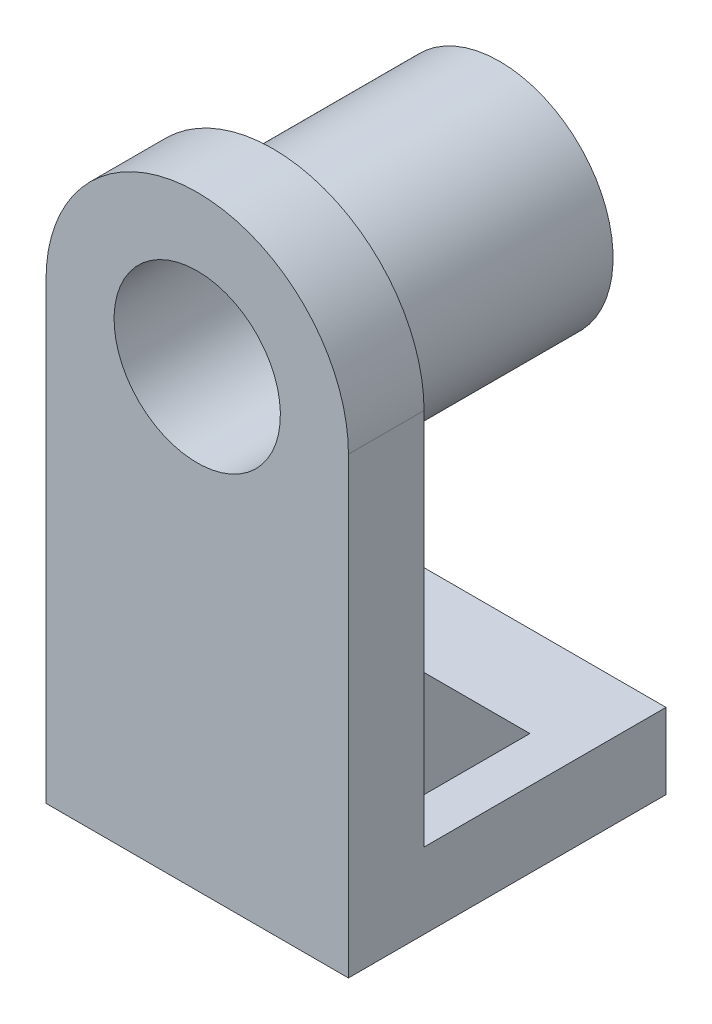
ISO-10303-21;
HEADER;
FILE_DESCRIPTION(('STEP AP214'),'2;1');
FILE_NAME('part.step','',(''),(''),'','','');
FILE_SCHEMA(('AUTOMOTIVE_DESIGN { 1 0 10303 214 1 1 1 1 }'));
ENDSEC;
DATA;
#1=APPLICATION_CONTEXT('core data for automotive mechanical design processes');
#2=APPLICATION_PROTOCOL_DEFINITION('international standard','automotive_design',2000,#1);
#3=PRODUCT_CONTEXT('',#1,'mechanical');
#4=PRODUCT('Part','Part','',(#3));
#5=PRODUCT_RELATED_PRODUCT_CATEGORY('part','',(#4));
#6=PRODUCT_DEFINITION_FORMATION('','',#4);
#7=PRODUCT_DEFINITION_CONTEXT('part definition',#1,'design');
#8=PRODUCT_DEFINITION('design','',#6,#7);
#9=PRODUCT_DEFINITION_SHAPE('','',#8);
#10=(LENGTH_UNIT() NAMED_UNIT(*) SI_UNIT(.MILLI.,.METRE.));
#11=(NAMED_UNIT(*) PLANE_ANGLE_UNIT() SI_UNIT($,.RADIAN.));
#12=(NAMED_UNIT(*) SI_UNIT($,.STERADIAN.) SOLID_ANGLE_UNIT());
#13=UNCERTAINTY_MEASURE_WITH_UNIT(LENGTH_MEASURE(1.E-05),#10,'distance_accuracy_value','');
#14=(GEOMETRIC_REPRESENTATION_CONTEXT(3) GLOBAL_UNCERTAINTY_ASSIGNED_CONTEXT((#13)) GLOBAL_UNIT_ASSIGNED_CONTEXT((#10,
#11,#12)) REPRESENTATION_CONTEXT('',''));
#15=CARTESIAN_POINT('',(0.,0.,0.));
#16=DIRECTION('',(0.,0.,1.));
#17=DIRECTION('',(1.,0.,0.));
#18=AXIS2_PLACEMENT_3D('',#15,#16,#17);
#19=CARTESIAN_POINT('',(20.,50.,10.));
#20=DIRECTION('',(0.,0.,-1.));
#21=DIRECTION('',(-1.,0.,0.));
#22=AXIS2_PLACEMENT_3D('',#19,#20,#21);
#23=CYLINDRICAL_SURFACE('',#22,20.);
#24=DIRECTION('',(0.,0.,-1.));
#25=VECTOR('',#24,1.);
#26=CARTESIAN_POINT('',(0.,50.,0.));
#27=LINE('',#26,#25);
#28=CARTESIAN_POINT('',(0.,50.,10.));
#29=VERTEX_POINT('',#28);
#30=CARTESIAN_POINT('',(0.,50.,0.));
#31=VERTEX_POINT('',#30);
#32=EDGE_CURVE('E161',#29,#31,#27,.T.);
#33=ORIENTED_EDGE('',*,*,#32,.F.);
#34=CARTESIAN_POINT('',(20.,50.,10.));
#35=DIRECTION('',(0.,0.,-1.));
#36=DIRECTION('',(0.,1.,0.));
#37=AXIS2_PLACEMENT_3D('',#34,#35,#36);
#38=CIRCLE('',#37,20.);
#39=CARTESIAN_POINT('',(40.,50.,10.));
#40=VERTEX_POINT('',#39);
#41=EDGE_CURVE('E43',#40,#29,#38,.F.);
#42=ORIENTED_EDGE('',*,*,#41,.F.);
#43=DIRECTION('',(0.,0.,1.));
#44=VECTOR('',#43,1.);
#45=CARTESIAN_POINT('',(40.,50.,10.));
#46=LINE('',#45,#44);
#47=CARTESIAN_POINT('',(40.,50.,0.));
#48=VERTEX_POINT('',#47);
#49=EDGE_CURVE('E164',#48,#40,#46,.T.);
#50=ORIENTED_EDGE('',*,*,#49,.F.);
#51=CARTESIAN_POINT('',(20.,50.,0.));
#52=DIRECTION('',(0.,0.,-1.));
#53=DIRECTION('',(0.,1.,0.));
#54=AXIS2_PLACEMENT_3D('',#51,#52,#53);
#55=CIRCLE('',#54,20.);
#56=EDGE_CURVE('E11',#31,#48,#55,.T.);
#57=ORIENTED_EDGE('',*,*,#56,.F.);
#58=EDGE_LOOP('',(#33,#42,#50,#57));
#59=FACE_BOUND('',#58,.T.);
#60=ADVANCED_FACE('F35',(#59),#23,.T.);
#61=CARTESIAN_POINT('',(40.,-10.,0.));
#62=DIRECTION('',(0.,1.,0.));
#63=DIRECTION('',(0.,0.,1.));
#64=AXIS2_PLACEMENT_3D('',#61,#62,#63);
#65=PLANE('',#64);
#66=DIRECTION('',(0.,0.,-1.));
#67=VECTOR('',#66,1.);
#68=CARTESIAN_POINT('',(0.,-10.,0.));
#69=LINE('',#68,#67);
#70=CARTESIAN_POINT('',(0.,-10.,10.));
#71=VERTEX_POINT('',#70);
#72=CARTESIAN_POINT('',(0.,-10.,-32.));
#73=VERTEX_POINT('',#72);
#74=EDGE_CURVE('E184',#71,#73,#69,.T.);
#75=ORIENTED_EDGE('',*,*,#74,.T.);
#76=DIRECTION('',(-1.,0.,0.));
#77=VECTOR('',#76,1.);
#78=CARTESIAN_POINT('',(40.,-10.,-32.));
#79=LINE('',#78,#77);
#80=CARTESIAN_POINT('',(40.,-10.,-32.));
#81=VERTEX_POINT('',#80);
#82=EDGE_CURVE('E159',#81,#73,#79,.T.);
#83=ORIENTED_EDGE('',*,*,#82,.F.);
#84=DIRECTION('',(0.,0.,-1.));
#85=VECTOR('',#84,1.);
#86=CARTESIAN_POINT('',(40.,-10.,0.));
#87=LINE('',#86,#85);
#88=CARTESIAN_POINT('',(40.,-10.,10.));
#89=VERTEX_POINT('',#88);
#90=EDGE_CURVE('E185',#89,#81,#87,.T.);
#91=ORIENTED_EDGE('',*,*,#90,.F.);
#92=DIRECTION('',(-1.,0.,0.));
#93=VECTOR('',#92,1.);
#94=CARTESIAN_POINT('',(40.,-10.,10.));
#95=LINE('',#94,#93);
#96=EDGE_CURVE('E154',#89,#71,#95,.T.);
#97=ORIENTED_EDGE('',*,*,#96,.T.);
#98=EDGE_LOOP('',(#75,#83,#91,#97));
#99=FACE_BOUND('',#98,.T.);
#100=ADVANCED_FACE('F260',(#99),#65,.F.);
#101=CARTESIAN_POINT('',(40.,0.,-32.));
#102=DIRECTION('',(0.,0.,-1.));
#103=DIRECTION('',(-1.,0.,0.));
#104=AXIS2_PLACEMENT_3D('',#101,#102,#103);
#105=PLANE('',#104);
#106=DIRECTION('',(0.,-1.,0.));
#107=VECTOR('',#106,1.);
#108=CARTESIAN_POINT('',(0.,0.,-32.));
#109=LINE('',#108,#107);
#110=CARTESIAN_POINT('',(0.,0.,-32.));
#111=VERTEX_POINT('',#110);
#112=EDGE_CURVE('E194',#111,#73,#109,.T.);
#113=ORIENTED_EDGE('',*,*,#112,.F.);
#114=DIRECTION('',(-1.,0.,0.));
#115=VECTOR('',#114,1.);
#116=CARTESIAN_POINT('',(40.,0.,-32.));
#117=LINE('',#116,#115);
#118=CARTESIAN_POINT('',(40.,0.,-32.));
#119=VERTEX_POINT('',#118);
#120=EDGE_CURVE('E153',#119,#111,#117,.T.);
#121=ORIENTED_EDGE('',*,*,#120,.F.);
#122=DIRECTION('',(0.,-1.,0.));
#123=VECTOR('',#122,1.);
#124=CARTESIAN_POINT('',(40.,0.,-32.));
#125=LINE('',#124,#123);
#126=EDGE_CURVE('E187',#119,#81,#125,.T.);
#127=ORIENTED_EDGE('',*,*,#126,.T.);
#128=ORIENTED_EDGE('',*,*,#82,.T.);
#129=EDGE_LOOP('',(#113,#121,#127,#128));
#130=FACE_BOUND('',#129,.T.);
#131=ADVANCED_FACE('F264',(#130),#105,.T.);
#132=CARTESIAN_POINT('',(40.,0.,0.));
#133=DIRECTION('',(0.,1.,0.));
#134=DIRECTION('',(0.,0.,1.));
#135=AXIS2_PLACEMENT_3D('',#132,#133,#134);
#136=PLANE('',#135);
#137=DIRECTION('',(0.,0.,1.));
#138=VECTOR('',#137,1.);
#139=CARTESIAN_POINT('',(30.,0.,-20.));
#140=LINE('',#139,#138);
#141=CARTESIAN_POINT('',(30.,0.,-20.));
#142=VERTEX_POINT('',#141);
#143=CARTESIAN_POINT('',(30.,0.,0.));
#144=VERTEX_POINT('',#143);
#145=EDGE_CURVE('E125',#142,#144,#140,.T.);
#146=ORIENTED_EDGE('',*,*,#145,.F.);
#147=DIRECTION('',(1.,0.,0.));
#148=VECTOR('',#147,1.);
#149=CARTESIAN_POINT('',(30.,0.,-20.));
#150=LINE('',#149,#148);
#151=CARTESIAN_POINT('',(34.,0.,-20.));
#152=VERTEX_POINT('',#151);
#153=EDGE_CURVE('E232',#142,#152,#150,.T.);
#154=ORIENTED_EDGE('',*,*,#153,.T.);
#155=DIRECTION('',(0.,0.,1.));
#156=VECTOR('',#155,1.);
#157=CARTESIAN_POINT('',(34.,0.,-20.));
#158=LINE('',#157,#156);
#159=CARTESIAN_POINT('',(34.,0.,0.));
#160=VERTEX_POINT('',#159);
#161=EDGE_CURVE('E236',#152,#160,#158,.T.);
#162=ORIENTED_EDGE('',*,*,#161,.T.);
#163=DIRECTION('',(-1.,0.,0.));
#164=VECTOR('',#163,1.);
#165=CARTESIAN_POINT('',(40.,0.,0.));
#166=LINE('',#165,#164);
#167=CARTESIAN_POINT('',(40.,0.,0.));
#168=VERTEX_POINT('',#167);
#169=EDGE_CURVE('E149',#168,#160,#166,.T.);
#170=ORIENTED_EDGE('',*,*,#169,.F.);
#171=DIRECTION('',(0.,0.,-1.));
#172=VECTOR('',#171,1.);
#173=CARTESIAN_POINT('',(40.,0.,0.));
#174=LINE('',#173,#172);
#175=EDGE_CURVE('E201',#168,#119,#174,.T.);
#176=ORIENTED_EDGE('',*,*,#175,.T.);
#177=ORIENTED_EDGE('',*,*,#120,.T.);
#178=DIRECTION('',(0.,0.,-1.));
#179=VECTOR('',#178,1.);
#180=CARTESIAN_POINT('',(0.,0.,0.));
#181=LINE('',#180,#179);
#182=CARTESIAN_POINT('',(0.,0.,0.));
#183=VERTEX_POINT('',#182);
#184=EDGE_CURVE('E189',#183,#111,#181,.T.);
#185=ORIENTED_EDGE('',*,*,#184,.F.);
#186=CARTESIAN_POINT('',(6.,0.,0.));
#187=VERTEX_POINT('',#186);
#188=EDGE_CURVE('E150',#187,#183,#166,.T.);
#189=ORIENTED_EDGE('',*,*,#188,.F.);
#190=DIRECTION('',(0.,0.,1.));
#191=VECTOR('',#190,1.);
#192=CARTESIAN_POINT('',(6.,0.,-20.));
#193=LINE('',#192,#191);
#194=CARTESIAN_POINT('',(6.,0.,-20.));
#195=VERTEX_POINT('',#194);
#196=EDGE_CURVE('E58',#195,#187,#193,.T.);
#197=ORIENTED_EDGE('',*,*,#196,.F.);
#198=DIRECTION('',(-1.,0.,0.));
#199=VECTOR('',#198,1.);
#200=CARTESIAN_POINT('',(10.,0.,-20.));
#201=LINE('',#200,#199);
#202=CARTESIAN_POINT('',(10.,0.,-20.));
#203=VERTEX_POINT('',#202);
#204=EDGE_CURVE('E215',#203,#195,#201,.T.);
#205=ORIENTED_EDGE('',*,*,#204,.F.);
#206=DIRECTION('',(0.,0.,1.));
#207=VECTOR('',#206,1.);
#208=CARTESIAN_POINT('',(10.,0.,-20.));
#209=LINE('',#208,#207);
#210=CARTESIAN_POINT('',(10.,0.,0.));
#211=VERTEX_POINT('',#210);
#212=EDGE_CURVE('E148',#203,#211,#209,.T.);
#213=ORIENTED_EDGE('',*,*,#212,.T.);
#214=EDGE_CURVE('E139',#144,#211,#166,.T.);
#215=ORIENTED_EDGE('',*,*,#214,.F.);
#216=EDGE_LOOP('',(#146,#154,#162,#170,#176,#177,#185,#189,#197,#205,#213,#215));
#217=FACE_BOUND('',#216,.T.);
#218=ADVANCED_FACE('F145',(#217),#136,.T.);
#219=CARTESIAN_POINT('',(40.,70.,0.));
#220=DIRECTION('',(0.,0.,-1.));
#221=DIRECTION('',(0.,1.,0.));
#222=AXIS2_PLACEMENT_3D('',#219,#220,#221);
#223=PLANE('',#222);
#224=DIRECTION('',(0.,1.,0.));
#225=VECTOR('',#224,1.);
#226=CARTESIAN_POINT('',(30.,0.,0.));
#227=LINE('',#226,#225);
#228=CARTESIAN_POINT('',(30.,20.,0.));
#229=VERTEX_POINT('',#228);
#230=EDGE_CURVE('E128',#144,#229,#227,.T.);
#231=ORIENTED_EDGE('',*,*,#230,.F.);
#232=ORIENTED_EDGE('',*,*,#214,.T.);
#233=DIRECTION('',(0.,1.,0.));
#234=VECTOR('',#233,1.);
#235=CARTESIAN_POINT('',(10.,0.,0.));
#236=LINE('',#235,#234);
#237=CARTESIAN_POINT('',(10.,20.,0.));
#238=VERTEX_POINT('',#237);
#239=EDGE_CURVE('E223',#211,#238,#236,.T.);
#240=ORIENTED_EDGE('',*,*,#239,.T.);
#241=DIRECTION('',(-1.,0.,0.));
#242=VECTOR('',#241,1.);
#243=CARTESIAN_POINT('',(10.,20.,0.));
#244=LINE('',#243,#242);
#245=CARTESIAN_POINT('',(6.,20.,0.));
#246=VERTEX_POINT('',#245);
#247=EDGE_CURVE('E218',#238,#246,#244,.T.);
#248=ORIENTED_EDGE('',*,*,#247,.T.);
#249=DIRECTION('',(0.,1.,0.));
#250=VECTOR('',#249,1.);
#251=CARTESIAN_POINT('',(6.,0.,0.));
#252=LINE('',#251,#250);
#253=EDGE_CURVE('E226',#187,#246,#252,.T.);
#254=ORIENTED_EDGE('',*,*,#253,.F.);
#255=ORIENTED_EDGE('',*,*,#188,.T.);
#256=DIRECTION('',(0.,-1.,0.));
#257=VECTOR('',#256,1.);
#258=CARTESIAN_POINT('',(0.,70.,0.));
#259=LINE('',#258,#257);
#260=EDGE_CURVE('E186',#31,#183,#259,.T.);
#261=ORIENTED_EDGE('',*,*,#260,.F.);
#262=ORIENTED_EDGE('',*,*,#56,.T.);
#263=DIRECTION('',(0.,-1.,0.));
#264=VECTOR('',#263,1.);
#265=CARTESIAN_POINT('',(40.,70.,0.));
#266=LINE('',#265,#264);
#267=EDGE_CURVE('E199',#48,#168,#266,.T.);
#268=ORIENTED_EDGE('',*,*,#267,.T.);
#269=ORIENTED_EDGE('',*,*,#169,.T.);
#270=DIRECTION('',(0.,1.,0.));
#271=VECTOR('',#270,1.);
#272=CARTESIAN_POINT('',(34.,0.,0.));
#273=LINE('',#272,#271);
#274=CARTESIAN_POINT('',(34.,20.,0.));
#275=VERTEX_POINT('',#274);
#276=EDGE_CURVE('E239',#160,#275,#273,.T.);
#277=ORIENTED_EDGE('',*,*,#276,.T.);
#278=DIRECTION('',(1.,0.,0.));
#279=VECTOR('',#278,1.);
#280=CARTESIAN_POINT('',(30.,20.,0.));
#281=LINE('',#280,#279);
#282=EDGE_CURVE('E50',#229,#275,#281,.T.);
#283=ORIENTED_EDGE('',*,*,#282,.F.);
#284=EDGE_LOOP('',(#231,#232,#240,#248,#254,#255,#261,#262,#268,#269,#277,#283));
#285=FACE_BOUND('',#284,.T.);
#286=CARTESIAN_POINT('',(20.,50.,0.));
#287=DIRECTION('',(0.,0.,-1.));
#288=DIRECTION('',(0.,1.,0.));
#289=AXIS2_PLACEMENT_3D('',#286,#287,#288);
#290=CIRCLE('',#289,15.);
#291=CARTESIAN_POINT('',(20.,65.,0.));
#292=VERTEX_POINT('',#291);
#293=EDGE_CURVE('E206',#292,#292,#290,.T.);
#294=ORIENTED_EDGE('',*,*,#293,.F.);
#295=EDGE_LOOP('',(#294));
#296=FACE_BOUND('',#295,.T.);
#297=ADVANCED_FACE('F136',(#285,#296),#223,.T.);
#298=CARTESIAN_POINT('',(40.,70.,10.));
#299=DIRECTION('',(0.,0.,-1.));
#300=DIRECTION('',(0.,1.,0.));
#301=AXIS2_PLACEMENT_3D('',#298,#299,#300);
#302=PLANE('',#301);
#303=CARTESIAN_POINT('',(20.,50.,10.));
#304=DIRECTION('',(0.,0.,-1.));
#305=DIRECTION('',(0.,1.,0.));
#306=AXIS2_PLACEMENT_3D('',#303,#304,#305);
#307=CIRCLE('',#306,11.);
#308=CARTESIAN_POINT('',(20.,61.,10.));
#309=VERTEX_POINT('',#308);
#310=EDGE_CURVE('E209',#309,#309,#307,.T.);
#311=ORIENTED_EDGE('',*,*,#310,.T.);
#312=EDGE_LOOP('',(#311));
#313=FACE_BOUND('',#312,.T.);
#314=DIRECTION('',(0.,-1.,0.));
#315=VECTOR('',#314,1.);
#316=CARTESIAN_POINT('',(40.,70.,10.));
#317=LINE('',#316,#315);
#318=EDGE_CURVE('E174',#40,#89,#317,.T.);
#319=ORIENTED_EDGE('',*,*,#318,.F.);
#320=ORIENTED_EDGE('',*,*,#41,.T.);
#321=DIRECTION('',(0.,-1.,0.));
#322=VECTOR('',#321,1.);
#323=CARTESIAN_POINT('',(0.,70.,10.));
#324=LINE('',#323,#322);
#325=EDGE_CURVE('E172',#29,#71,#324,.T.);
#326=ORIENTED_EDGE('',*,*,#325,.T.);
#327=ORIENTED_EDGE('',*,*,#96,.F.);
#328=EDGE_LOOP('',(#319,#320,#326,#327));
#329=FACE_BOUND('',#328,.T.);
#330=ADVANCED_FACE('F169',(#313,#329),#302,.F.);
#331=CARTESIAN_POINT('',(40.,0.,0.));
#332=DIRECTION('',(-1.,0.,0.));
#333=DIRECTION('',(0.,0.,1.));
#334=AXIS2_PLACEMENT_3D('',#331,#332,#333);
#335=PLANE('',#334);
#336=ORIENTED_EDGE('',*,*,#267,.F.);
#337=ORIENTED_EDGE('',*,*,#49,.T.);
#338=ORIENTED_EDGE('',*,*,#318,.T.);
#339=ORIENTED_EDGE('',*,*,#90,.T.);
#340=ORIENTED_EDGE('',*,*,#126,.F.);
#341=ORIENTED_EDGE('',*,*,#175,.F.);
#342=EDGE_LOOP('',(#336,#337,#338,#339,#340,#341));
#343=FACE_BOUND('',#342,.T.);
#344=ADVANCED_FACE('F278',(#343),#335,.F.);
#345=CARTESIAN_POINT('',(0.,0.,0.));
#346=DIRECTION('',(-1.,0.,0.));
#347=DIRECTION('',(0.,0.,1.));
#348=AXIS2_PLACEMENT_3D('',#345,#346,#347);
#349=PLANE('',#348);
#350=ORIENTED_EDGE('',*,*,#325,.F.);
#351=ORIENTED_EDGE('',*,*,#32,.T.);
#352=ORIENTED_EDGE('',*,*,#260,.T.);
#353=ORIENTED_EDGE('',*,*,#184,.T.);
#354=ORIENTED_EDGE('',*,*,#112,.T.);
#355=ORIENTED_EDGE('',*,*,#74,.F.);
#356=EDGE_LOOP('',(#350,#351,#352,#353,#354,#355));
#357=FACE_BOUND('',#356,.T.);
#358=ADVANCED_FACE('F181',(#357),#349,.T.);
#359=CARTESIAN_POINT('',(20.,50.,-30.));
#360=DIRECTION('',(0.,0.,1.));
#361=DIRECTION('',(0.,-1.,0.));
#362=AXIS2_PLACEMENT_3D('',#359,#360,#361);
#363=CYLINDRICAL_SURFACE('',#362,15.);
#364=CARTESIAN_POINT('',(20.,50.,-30.));
#365=DIRECTION('',(0.,0.,-1.));
#366=DIRECTION('',(0.,1.,0.));
#367=AXIS2_PLACEMENT_3D('',#364,#365,#366);
#368=CIRCLE('',#367,15.);
#369=CARTESIAN_POINT('',(20.,65.,-30.));
#370=VERTEX_POINT('',#369);
#371=EDGE_CURVE('E197',#370,#370,#368,.T.);
#372=ORIENTED_EDGE('',*,*,#371,.F.);
#373=EDGE_LOOP('',(#372));
#374=FACE_BOUND('',#373,.T.);
#375=ORIENTED_EDGE('',*,*,#293,.T.);
#376=EDGE_LOOP('',(#375));
#377=FACE_BOUND('',#376,.T.);
#378=ADVANCED_FACE('F282',(#374,#377),#363,.T.);
#379=CARTESIAN_POINT('',(20.,50.,-30.));
#380=DIRECTION('',(0.,0.,-1.));
#381=DIRECTION('',(0.,1.,0.));
#382=AXIS2_PLACEMENT_3D('',#379,#380,#381);
#383=PLANE('',#382);
#384=CARTESIAN_POINT('',(20.,50.,-30.));
#385=DIRECTION('',(0.,0.,-1.));
#386=DIRECTION('',(0.,1.,0.));
#387=AXIS2_PLACEMENT_3D('',#384,#385,#386);
#388=CIRCLE('',#387,11.);
#389=CARTESIAN_POINT('',(20.,61.,-30.));
#390=VERTEX_POINT('',#389);
#391=EDGE_CURVE('E212',#390,#390,#388,.T.);
#392=ORIENTED_EDGE('',*,*,#391,.F.);
#393=EDGE_LOOP('',(#392));
#394=FACE_BOUND('',#393,.T.);
#395=ORIENTED_EDGE('',*,*,#371,.T.);
#396=EDGE_LOOP('',(#395));
#397=FACE_BOUND('',#396,.T.);
#398=ADVANCED_FACE('F288',(#394,#397),#383,.T.);
#399=CARTESIAN_POINT('',(20.,50.,10.));
#400=DIRECTION('',(0.,0.,-1.));
#401=DIRECTION('',(0.,1.,0.));
#402=AXIS2_PLACEMENT_3D('',#399,#400,#401);
#403=CYLINDRICAL_SURFACE('',#402,11.);
#404=ORIENTED_EDGE('',*,*,#310,.F.);
#405=EDGE_LOOP('',(#404));
#406=FACE_BOUND('',#405,.T.);
#407=ORIENTED_EDGE('',*,*,#391,.T.);
#408=EDGE_LOOP('',(#407));
#409=FACE_BOUND('',#408,.T.);
#410=ADVANCED_FACE('F292',(#406,#409),#403,.F.);
#411=CARTESIAN_POINT('',(10.,20.,0.));
#412=DIRECTION('',(0.,0.707106781186548,-0.707106781186547));
#413=DIRECTION('',(0.,0.707106781186547,0.707106781186548));
#414=AXIS2_PLACEMENT_3D('',#411,#412,#413);
#415=PLANE('',#414);
#416=DIRECTION('',(0.,-0.707106781186547,-0.707106781186548));
#417=VECTOR('',#416,1.);
#418=CARTESIAN_POINT('',(6.,20.,0.));
#419=LINE('',#418,#417);
#420=EDGE_CURVE('E224',#246,#195,#419,.T.);
#421=ORIENTED_EDGE('',*,*,#420,.F.);
#422=ORIENTED_EDGE('',*,*,#247,.F.);
#423=DIRECTION('',(0.,-0.707106781186547,-0.707106781186548));
#424=VECTOR('',#423,1.);
#425=CARTESIAN_POINT('',(10.,20.,0.));
#426=LINE('',#425,#424);
#427=EDGE_CURVE('E229',#238,#203,#426,.T.);
#428=ORIENTED_EDGE('',*,*,#427,.T.);
#429=ORIENTED_EDGE('',*,*,#204,.T.);
#430=EDGE_LOOP('',(#421,#422,#428,#429));
#431=FACE_BOUND('',#430,.T.);
#432=ADVANCED_FACE('F296',(#431),#415,.T.);
#433=CARTESIAN_POINT('',(10.,0.,0.));
#434=DIRECTION('',(1.,0.,0.));
#435=DIRECTION('',(0.,0.,-1.));
#436=AXIS2_PLACEMENT_3D('',#433,#434,#435);
#437=PLANE('',#436);
#438=ORIENTED_EDGE('',*,*,#239,.F.);
#439=ORIENTED_EDGE('',*,*,#212,.F.);
#440=ORIENTED_EDGE('',*,*,#427,.F.);
#441=EDGE_LOOP('',(#438,#439,#440));
#442=FACE_BOUND('',#441,.T.);
#443=ADVANCED_FACE('F255',(#442),#437,.T.);
#444=CARTESIAN_POINT('',(6.,0.,0.));
#445=DIRECTION('',(1.,0.,0.));
#446=DIRECTION('',(0.,0.,-1.));
#447=AXIS2_PLACEMENT_3D('',#444,#445,#446);
#448=PLANE('',#447);
#449=ORIENTED_EDGE('',*,*,#253,.T.);
#450=ORIENTED_EDGE('',*,*,#420,.T.);
#451=ORIENTED_EDGE('',*,*,#196,.T.);
#452=EDGE_LOOP('',(#449,#450,#451));
#453=FACE_BOUND('',#452,.T.);
#454=ADVANCED_FACE('F248',(#453),#448,.F.);
#455=CARTESIAN_POINT('',(30.,20.,0.));
#456=DIRECTION('',(0.,-0.707106781186548,0.707106781186547));
#457=DIRECTION('',(0.,-0.707106781186547,-0.707106781186548));
#458=AXIS2_PLACEMENT_3D('',#455,#456,#457);
#459=PLANE('',#458);
#460=DIRECTION('',(0.,-0.707106781186547,-0.707106781186548));
#461=VECTOR('',#460,1.);
#462=CARTESIAN_POINT('',(34.,20.,0.));
#463=LINE('',#462,#461);
#464=EDGE_CURVE('E142',#275,#152,#463,.T.);
#465=ORIENTED_EDGE('',*,*,#464,.T.);
#466=ORIENTED_EDGE('',*,*,#153,.F.);
#467=DIRECTION('',(0.,-0.707106781186547,-0.707106781186548));
#468=VECTOR('',#467,1.);
#469=CARTESIAN_POINT('',(30.,20.,0.));
#470=LINE('',#469,#468);
#471=EDGE_CURVE('E129',#229,#142,#470,.T.);
#472=ORIENTED_EDGE('',*,*,#471,.F.);
#473=ORIENTED_EDGE('',*,*,#282,.T.);
#474=EDGE_LOOP('',(#465,#466,#472,#473));
#475=FACE_BOUND('',#474,.T.);
#476=ADVANCED_FACE('F246',(#475),#459,.F.);
#477=CARTESIAN_POINT('',(30.,0.,0.));
#478=DIRECTION('',(-1.,0.,0.));
#479=DIRECTION('',(0.,0.,-1.));
#480=AXIS2_PLACEMENT_3D('',#477,#478,#479);
#481=PLANE('',#480);
#482=ORIENTED_EDGE('',*,*,#230,.T.);
#483=ORIENTED_EDGE('',*,*,#471,.T.);
#484=ORIENTED_EDGE('',*,*,#145,.T.);
#485=EDGE_LOOP('',(#482,#483,#484));
#486=FACE_BOUND('',#485,.T.);
#487=ADVANCED_FACE('F127',(#486),#481,.T.);
#488=CARTESIAN_POINT('',(34.,0.,0.));
#489=DIRECTION('',(-1.,0.,0.));
#490=DIRECTION('',(0.,0.,-1.));
#491=AXIS2_PLACEMENT_3D('',#488,#489,#490);
#492=PLANE('',#491);
#493=ORIENTED_EDGE('',*,*,#276,.F.);
#494=ORIENTED_EDGE('',*,*,#161,.F.);
#495=ORIENTED_EDGE('',*,*,#464,.F.);
#496=EDGE_LOOP('',(#493,#494,#495));
#497=FACE_BOUND('',#496,.T.);
#498=ADVANCED_FACE('F244',(#497),#492,.F.);
#499=CLOSED_SHELL('',(#60,#100,#131,#218,#297,#330,#344,#358,#378,#398,#410,#432,#443,#454,#476,
#487,#498));
#500=MANIFOLD_SOLID_BREP('B2',#499);
#501=ADVANCED_BREP_SHAPE_REPRESENTATION('',(#18,#500),#14);
#502=SHAPE_DEFINITION_REPRESENTATION(#9,#501);
ENDSEC;
END-ISO-10303-21;
